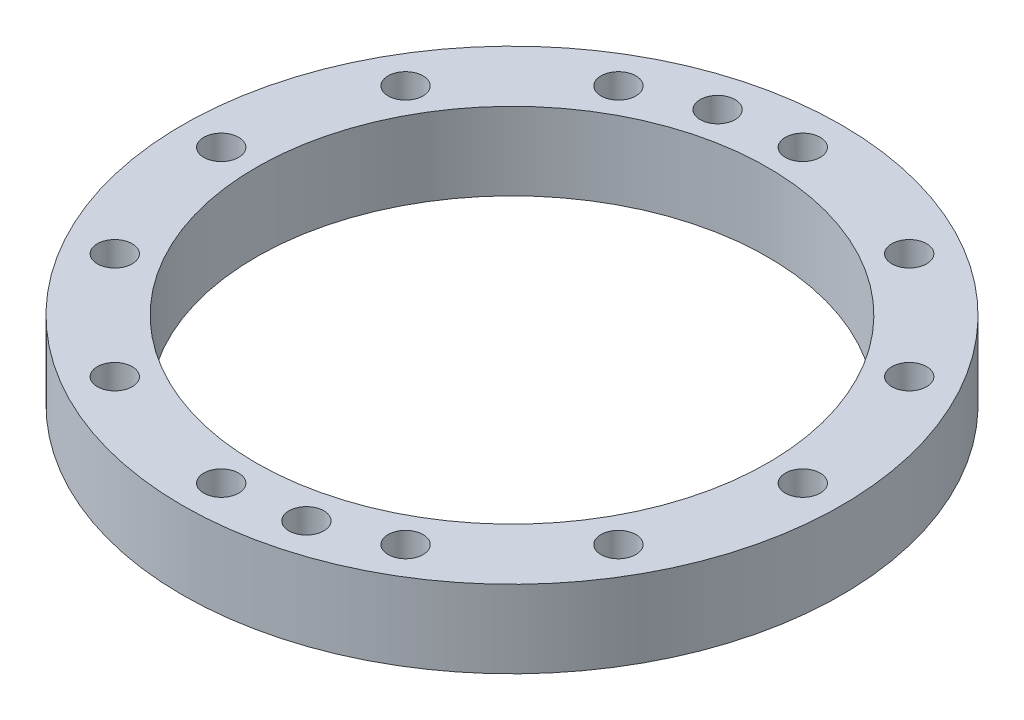
ISO-10303-21;
HEADER;
FILE_DESCRIPTION(('STEP AP214'),'2;1');
FILE_NAME('part.step','',(''),(''),'','','');
FILE_SCHEMA(('AUTOMOTIVE_DESIGN { 1 0 10303 214 1 1 1 1 }'));
ENDSEC;
DATA;
#1=APPLICATION_CONTEXT('core data for automotive mechanical design processes');
#2=APPLICATION_PROTOCOL_DEFINITION('international standard','automotive_design',2000,#1);
#3=PRODUCT_CONTEXT('',#1,'mechanical');
#4=PRODUCT('Part','Part','',(#3));
#5=PRODUCT_RELATED_PRODUCT_CATEGORY('part','',(#4));
#6=PRODUCT_DEFINITION_FORMATION('','',#4);
#7=PRODUCT_DEFINITION_CONTEXT('part definition',#1,'design');
#8=PRODUCT_DEFINITION('design','',#6,#7);
#9=PRODUCT_DEFINITION_SHAPE('','',#8);
#10=(LENGTH_UNIT() NAMED_UNIT(*) SI_UNIT(.MILLI.,.METRE.));
#11=(NAMED_UNIT(*) PLANE_ANGLE_UNIT() SI_UNIT($,.RADIAN.));
#12=(NAMED_UNIT(*) SI_UNIT($,.STERADIAN.) SOLID_ANGLE_UNIT());
#13=UNCERTAINTY_MEASURE_WITH_UNIT(LENGTH_MEASURE(1.E-05),#10,'distance_accuracy_value','');
#14=(GEOMETRIC_REPRESENTATION_CONTEXT(3) GLOBAL_UNCERTAINTY_ASSIGNED_CONTEXT((#13)) GLOBAL_UNIT_ASSIGNED_CONTEXT((#10,
#11,#12)) REPRESENTATION_CONTEXT('',''));
#15=CARTESIAN_POINT('',(0.,0.,0.));
#16=DIRECTION('',(0.,0.,1.));
#17=DIRECTION('',(1.,0.,0.));
#18=AXIS2_PLACEMENT_3D('',#15,#16,#17);
#19=CARTESIAN_POINT('',(0.,10.,0.));
#20=DIRECTION('',(0.,1.,0.));
#21=DIRECTION('',(0.,0.,1.));
#22=AXIS2_PLACEMENT_3D('',#19,#20,#21);
#23=PLANE('',#22);
#24=CARTESIAN_POINT('',(9.70571419134456,10.,36.2222184858401));
#25=DIRECTION('',(0.,1.,0.));
#26=DIRECTION('',(0.,0.,-1.));
#27=AXIS2_PLACEMENT_3D('',#24,#25,#26);
#28=CIRCLE('',#27,2.25);
#29=CARTESIAN_POINT('',(9.70571419134456,10.,33.9722184858401));
#30=VERTEX_POINT('',#29);
#31=EDGE_CURVE('E128',#30,#30,#28,.T.);
#32=ORIENTED_EDGE('',*,*,#31,.F.);
#33=EDGE_LOOP('',(#32));
#34=FACE_BOUND('',#33,.T.);
#35=CARTESIAN_POINT('',(-9.70571419134456,10.,-36.2222184858401));
#36=DIRECTION('',(0.,1.,0.));
#37=DIRECTION('',(0.,0.,1.));
#38=AXIS2_PLACEMENT_3D('',#35,#36,#37);
#39=CIRCLE('',#38,2.25);
#40=CARTESIAN_POINT('',(-9.70571419134456,10.,-33.9722184858401));
#41=VERTEX_POINT('',#40);
#42=EDGE_CURVE('E122',#41,#41,#39,.T.);
#43=ORIENTED_EDGE('',*,*,#42,.F.);
#44=EDGE_LOOP('',(#43));
#45=FACE_BOUND('',#44,.T.);
#46=CARTESIAN_POINT('',(-32.4759526419165,10.,-18.7499999999999));
#47=DIRECTION('',(0.,1.,0.));
#48=DIRECTION('',(0.86602540378444,0.,0.499999999999998));
#49=AXIS2_PLACEMENT_3D('',#46,#47,#48);
#50=CIRCLE('',#49,2.25);
#51=CARTESIAN_POINT('',(-30.5273954834015,10.,-17.6249999999999));
#52=VERTEX_POINT('',#51);
#53=EDGE_CURVE('E105',#52,#52,#50,.T.);
#54=ORIENTED_EDGE('',*,*,#53,.F.);
#55=EDGE_LOOP('',(#54));
#56=FACE_BOUND('',#55,.T.);
#57=CARTESIAN_POINT('',(-37.5,10.,1.30930550206618E-13));
#58=DIRECTION('',(0.,1.,0.));
#59=DIRECTION('',(1.,0.,0.));
#60=AXIS2_PLACEMENT_3D('',#57,#58,#59);
#61=CIRCLE('',#60,2.25);
#62=CARTESIAN_POINT('',(-35.25,10.,1.2307471719422E-13));
#63=VERTEX_POINT('',#62);
#64=EDGE_CURVE('E99',#63,#63,#61,.T.);
#65=ORIENTED_EDGE('',*,*,#64,.F.);
#66=EDGE_LOOP('',(#65));
#67=FACE_BOUND('',#66,.T.);
#68=CARTESIAN_POINT('',(-32.4759526419164,10.,18.7500000000002));
#69=DIRECTION('',(0.,1.,0.));
#70=DIRECTION('',(0.866025403784436,0.,-0.500000000000004));
#71=AXIS2_PLACEMENT_3D('',#68,#69,#70);
#72=CIRCLE('',#71,2.25);
#73=CARTESIAN_POINT('',(-30.5273954834014,10.,17.6250000000001));
#74=VERTEX_POINT('',#73);
#75=EDGE_CURVE('E93',#74,#74,#72,.T.);
#76=ORIENTED_EDGE('',*,*,#75,.F.);
#77=EDGE_LOOP('',(#76));
#78=FACE_BOUND('',#77,.T.);
#79=CARTESIAN_POINT('',(-18.7499999999998,10.,32.4759526419166));
#80=DIRECTION('',(0.,1.,0.));
#81=DIRECTION('',(0.499999999999995,0.,-0.866025403784442));
#82=AXIS2_PLACEMENT_3D('',#79,#80,#81);
#83=CIRCLE('',#82,2.25);
#84=CARTESIAN_POINT('',(-17.6249999999998,10.,30.5273954834016));
#85=VERTEX_POINT('',#84);
#86=EDGE_CURVE('E87',#85,#85,#83,.T.);
#87=ORIENTED_EDGE('',*,*,#86,.F.);
#88=EDGE_LOOP('',(#87));
#89=FACE_BOUND('',#88,.T.);
#90=CARTESIAN_POINT('',(0.,10.,37.5));
#91=DIRECTION('',(0.,1.,0.));
#92=DIRECTION('',(0.,0.,-1.));
#93=AXIS2_PLACEMENT_3D('',#90,#91,#92);
#94=CIRCLE('',#93,2.25);
#95=CARTESIAN_POINT('',(0.,10.,35.25));
#96=VERTEX_POINT('',#95);
#97=EDGE_CURVE('E81',#96,#96,#94,.T.);
#98=ORIENTED_EDGE('',*,*,#97,.F.);
#99=EDGE_LOOP('',(#98));
#100=FACE_BOUND('',#99,.T.);
#101=CARTESIAN_POINT('',(18.7500000000003,10.,32.4759526419163));
#102=DIRECTION('',(0.,1.,0.));
#103=DIRECTION('',(-0.500000000000007,0.,-0.866025403784435));
#104=AXIS2_PLACEMENT_3D('',#101,#102,#103);
#105=CIRCLE('',#104,2.25);
#106=CARTESIAN_POINT('',(17.6250000000003,10.,30.5273954834013));
#107=VERTEX_POINT('',#106);
#108=EDGE_CURVE('E75',#107,#107,#105,.T.);
#109=ORIENTED_EDGE('',*,*,#108,.F.);
#110=EDGE_LOOP('',(#109));
#111=FACE_BOUND('',#110,.T.);
#112=CARTESIAN_POINT('',(32.4759526419166,10.,18.7499999999997));
#113=DIRECTION('',(0.,1.,0.));
#114=DIRECTION('',(-0.866025403784443,0.,-0.499999999999992));
#115=AXIS2_PLACEMENT_3D('',#112,#113,#114);
#116=CIRCLE('',#115,2.25);
#117=CARTESIAN_POINT('',(30.5273954834016,10.,17.6249999999997));
#118=VERTEX_POINT('',#117);
#119=EDGE_CURVE('E69',#118,#118,#116,.T.);
#120=ORIENTED_EDGE('',*,*,#119,.F.);
#121=EDGE_LOOP('',(#120));
#122=FACE_BOUND('',#121,.T.);
#123=CARTESIAN_POINT('',(37.5,10.,-3.92791650619852E-13));
#124=DIRECTION('',(0.,1.,0.));
#125=DIRECTION('',(-1.,0.,0.));
#126=AXIS2_PLACEMENT_3D('',#123,#124,#125);
#127=CIRCLE('',#126,2.25);
#128=CARTESIAN_POINT('',(35.25,10.,-3.69224151582661E-13));
#129=VERTEX_POINT('',#128);
#130=EDGE_CURVE('E62',#129,#129,#127,.T.);
#131=ORIENTED_EDGE('',*,*,#130,.F.);
#132=EDGE_LOOP('',(#131));
#133=FACE_BOUND('',#132,.T.);
#134=CARTESIAN_POINT('',(32.4759526419162,10.,-18.7500000000004));
#135=DIRECTION('',(0.,1.,0.));
#136=DIRECTION('',(-0.866025403784433,0.,0.50000000000001));
#137=AXIS2_PLACEMENT_3D('',#134,#135,#136);
#138=CIRCLE('',#137,2.25);
#139=CARTESIAN_POINT('',(30.5273954834013,10.,-17.6250000000004));
#140=VERTEX_POINT('',#139);
#141=EDGE_CURVE('E117',#140,#140,#138,.T.);
#142=ORIENTED_EDGE('',*,*,#141,.F.);
#143=EDGE_LOOP('',(#142));
#144=FACE_BOUND('',#143,.T.);
#145=CARTESIAN_POINT('',(18.7499999999996,10.,-32.4759526419167));
#146=DIRECTION('',(0.,1.,0.));
#147=DIRECTION('',(-0.499999999999989,0.,0.866025403784445));
#148=AXIS2_PLACEMENT_3D('',#145,#146,#147);
#149=CIRCLE('',#148,2.25);
#150=CARTESIAN_POINT('',(17.6249999999996,10.,-30.5273954834017));
#151=VERTEX_POINT('',#150);
#152=EDGE_CURVE('E110',#151,#151,#149,.T.);
#153=ORIENTED_EDGE('',*,*,#152,.F.);
#154=EDGE_LOOP('',(#153));
#155=FACE_BOUND('',#154,.T.);
#156=CARTESIAN_POINT('',(-18.75,10.,-32.4759526419164));
#157=DIRECTION('',(0.,1.,0.));
#158=DIRECTION('',(0.500000000000001,0.,0.866025403784438));
#159=AXIS2_PLACEMENT_3D('',#156,#157,#158);
#160=CIRCLE('',#159,2.25);
#161=CARTESIAN_POINT('',(-17.625,10.,-30.5273954834014));
#162=VERTEX_POINT('',#161);
#163=EDGE_CURVE('E56',#162,#162,#160,.T.);
#164=ORIENTED_EDGE('',*,*,#163,.F.);
#165=EDGE_LOOP('',(#164));
#166=FACE_BOUND('',#165,.T.);
#167=CARTESIAN_POINT('',(0.,10.,-37.5));
#168=DIRECTION('',(0.,1.,0.));
#169=DIRECTION('',(0.,0.,1.));
#170=AXIS2_PLACEMENT_3D('',#167,#168,#169);
#171=CIRCLE('',#170,2.25);
#172=CARTESIAN_POINT('',(0.,10.,-35.25));
#173=VERTEX_POINT('',#172);
#174=EDGE_CURVE('E50',#173,#173,#171,.T.);
#175=ORIENTED_EDGE('',*,*,#174,.F.);
#176=EDGE_LOOP('',(#175));
#177=FACE_BOUND('',#176,.T.);
#178=CARTESIAN_POINT('',(0.,10.,0.));
#179=DIRECTION('',(0.,1.,0.));
#180=DIRECTION('',(0.,0.,1.));
#181=AXIS2_PLACEMENT_3D('',#178,#179,#180);
#182=CIRCLE('',#181,42.5);
#183=CARTESIAN_POINT('',(0.,10.,42.5));
#184=VERTEX_POINT('',#183);
#185=EDGE_CURVE('E10',#184,#184,#182,.T.);
#186=ORIENTED_EDGE('',*,*,#185,.T.);
#187=EDGE_LOOP('',(#186));
#188=FACE_BOUND('',#187,.T.);
#189=CARTESIAN_POINT('',(0.,10.,0.));
#190=DIRECTION('',(0.,1.,0.));
#191=DIRECTION('',(0.,0.,1.));
#192=AXIS2_PLACEMENT_3D('',#189,#190,#191);
#193=CIRCLE('',#192,33.);
#194=CARTESIAN_POINT('',(0.,10.,33.));
#195=VERTEX_POINT('',#194);
#196=EDGE_CURVE('E42',#195,#195,#193,.T.);
#197=ORIENTED_EDGE('',*,*,#196,.F.);
#198=EDGE_LOOP('',(#197));
#199=FACE_BOUND('',#198,.T.);
#200=ADVANCED_FACE('F31',(#34,#45,#56,#67,#78,#89,#100,#111,#122,#133,#144,#155,#166,#177,#188,
#199),#23,.T.);
#201=CARTESIAN_POINT('',(0.,0.,0.));
#202=DIRECTION('',(0.,1.,0.));
#203=DIRECTION('',(0.,0.,1.));
#204=AXIS2_PLACEMENT_3D('',#201,#202,#203);
#205=PLANE('',#204);
#206=CARTESIAN_POINT('',(9.70571419134456,0.,36.2222184858401));
#207=DIRECTION('',(0.,1.,0.));
#208=DIRECTION('',(0.,0.,-1.));
#209=AXIS2_PLACEMENT_3D('',#206,#207,#208);
#210=CIRCLE('',#209,2.25);
#211=CARTESIAN_POINT('',(9.70571419134456,0.,33.9722184858401));
#212=VERTEX_POINT('',#211);
#213=EDGE_CURVE('E125',#212,#212,#210,.T.);
#214=ORIENTED_EDGE('',*,*,#213,.T.);
#215=EDGE_LOOP('',(#214));
#216=FACE_BOUND('',#215,.T.);
#217=CARTESIAN_POINT('',(-9.70571419134456,0.,-36.2222184858401));
#218=DIRECTION('',(0.,1.,0.));
#219=DIRECTION('',(0.,0.,1.));
#220=AXIS2_PLACEMENT_3D('',#217,#218,#219);
#221=CIRCLE('',#220,2.25);
#222=CARTESIAN_POINT('',(-9.70571419134456,0.,-33.9722184858401));
#223=VERTEX_POINT('',#222);
#224=EDGE_CURVE('E114',#223,#223,#221,.T.);
#225=ORIENTED_EDGE('',*,*,#224,.T.);
#226=EDGE_LOOP('',(#225));
#227=FACE_BOUND('',#226,.T.);
#228=CARTESIAN_POINT('',(-32.4759526419165,0.,-18.7499999999999));
#229=DIRECTION('',(0.,1.,0.));
#230=DIRECTION('',(0.86602540378444,0.,0.499999999999998));
#231=AXIS2_PLACEMENT_3D('',#228,#229,#230);
#232=CIRCLE('',#231,2.25);
#233=CARTESIAN_POINT('',(-30.5273954834015,0.,-17.6249999999999));
#234=VERTEX_POINT('',#233);
#235=EDGE_CURVE('E59',#234,#234,#232,.T.);
#236=ORIENTED_EDGE('',*,*,#235,.T.);
#237=EDGE_LOOP('',(#236));
#238=FACE_BOUND('',#237,.T.);
#239=CARTESIAN_POINT('',(-37.5,0.,1.30930550206618E-13));
#240=DIRECTION('',(0.,1.,0.));
#241=DIRECTION('',(1.,0.,0.));
#242=AXIS2_PLACEMENT_3D('',#239,#240,#241);
#243=CIRCLE('',#242,2.25);
#244=CARTESIAN_POINT('',(-35.25,0.,1.2307471719422E-13));
#245=VERTEX_POINT('',#244);
#246=EDGE_CURVE('E102',#245,#245,#243,.T.);
#247=ORIENTED_EDGE('',*,*,#246,.T.);
#248=EDGE_LOOP('',(#247));
#249=FACE_BOUND('',#248,.T.);
#250=CARTESIAN_POINT('',(-32.4759526419164,0.,18.7500000000002));
#251=DIRECTION('',(0.,1.,0.));
#252=DIRECTION('',(0.866025403784436,0.,-0.500000000000004));
#253=AXIS2_PLACEMENT_3D('',#250,#251,#252);
#254=CIRCLE('',#253,2.25);
#255=CARTESIAN_POINT('',(-30.5273954834014,0.,17.6250000000001));
#256=VERTEX_POINT('',#255);
#257=EDGE_CURVE('E96',#256,#256,#254,.T.);
#258=ORIENTED_EDGE('',*,*,#257,.T.);
#259=EDGE_LOOP('',(#258));
#260=FACE_BOUND('',#259,.T.);
#261=CARTESIAN_POINT('',(-18.7499999999998,0.,32.4759526419166));
#262=DIRECTION('',(0.,1.,0.));
#263=DIRECTION('',(0.499999999999995,0.,-0.866025403784442));
#264=AXIS2_PLACEMENT_3D('',#261,#262,#263);
#265=CIRCLE('',#264,2.25);
#266=CARTESIAN_POINT('',(-17.6249999999998,0.,30.5273954834016));
#267=VERTEX_POINT('',#266);
#268=EDGE_CURVE('E90',#267,#267,#265,.T.);
#269=ORIENTED_EDGE('',*,*,#268,.T.);
#270=EDGE_LOOP('',(#269));
#271=FACE_BOUND('',#270,.T.);
#272=CARTESIAN_POINT('',(0.,0.,37.5));
#273=DIRECTION('',(0.,1.,0.));
#274=DIRECTION('',(0.,0.,-1.));
#275=AXIS2_PLACEMENT_3D('',#272,#273,#274);
#276=CIRCLE('',#275,2.25);
#277=CARTESIAN_POINT('',(0.,0.,35.25));
#278=VERTEX_POINT('',#277);
#279=EDGE_CURVE('E84',#278,#278,#276,.T.);
#280=ORIENTED_EDGE('',*,*,#279,.T.);
#281=EDGE_LOOP('',(#280));
#282=FACE_BOUND('',#281,.T.);
#283=CARTESIAN_POINT('',(18.7500000000003,0.,32.4759526419163));
#284=DIRECTION('',(0.,1.,0.));
#285=DIRECTION('',(-0.500000000000007,0.,-0.866025403784435));
#286=AXIS2_PLACEMENT_3D('',#283,#284,#285);
#287=CIRCLE('',#286,2.25);
#288=CARTESIAN_POINT('',(17.6250000000003,0.,30.5273954834013));
#289=VERTEX_POINT('',#288);
#290=EDGE_CURVE('E78',#289,#289,#287,.T.);
#291=ORIENTED_EDGE('',*,*,#290,.T.);
#292=EDGE_LOOP('',(#291));
#293=FACE_BOUND('',#292,.T.);
#294=CARTESIAN_POINT('',(32.4759526419166,0.,18.7499999999997));
#295=DIRECTION('',(0.,1.,0.));
#296=DIRECTION('',(-0.866025403784443,0.,-0.499999999999992));
#297=AXIS2_PLACEMENT_3D('',#294,#295,#296);
#298=CIRCLE('',#297,2.25);
#299=CARTESIAN_POINT('',(30.5273954834016,0.,17.6249999999997));
#300=VERTEX_POINT('',#299);
#301=EDGE_CURVE('E72',#300,#300,#298,.T.);
#302=ORIENTED_EDGE('',*,*,#301,.T.);
#303=EDGE_LOOP('',(#302));
#304=FACE_BOUND('',#303,.T.);
#305=CARTESIAN_POINT('',(37.5,0.,-3.92791650619852E-13));
#306=DIRECTION('',(0.,1.,0.));
#307=DIRECTION('',(-1.,0.,0.));
#308=AXIS2_PLACEMENT_3D('',#305,#306,#307);
#309=CIRCLE('',#308,2.25);
#310=CARTESIAN_POINT('',(35.25,0.,-3.69224151582661E-13));
#311=VERTEX_POINT('',#310);
#312=EDGE_CURVE('E65',#311,#311,#309,.T.);
#313=ORIENTED_EDGE('',*,*,#312,.T.);
#314=EDGE_LOOP('',(#313));
#315=FACE_BOUND('',#314,.T.);
#316=CARTESIAN_POINT('',(32.4759526419162,0.,-18.7500000000004));
#317=DIRECTION('',(0.,1.,0.));
#318=DIRECTION('',(-0.866025403784433,0.,0.50000000000001));
#319=AXIS2_PLACEMENT_3D('',#316,#317,#318);
#320=CIRCLE('',#319,2.25);
#321=CARTESIAN_POINT('',(30.5273954834013,0.,-17.6250000000004));
#322=VERTEX_POINT('',#321);
#323=EDGE_CURVE('E66',#322,#322,#320,.T.);
#324=ORIENTED_EDGE('',*,*,#323,.T.);
#325=EDGE_LOOP('',(#324));
#326=FACE_BOUND('',#325,.T.);
#327=CARTESIAN_POINT('',(18.7499999999996,0.,-32.4759526419167));
#328=DIRECTION('',(0.,1.,0.));
#329=DIRECTION('',(-0.499999999999989,0.,0.866025403784445));
#330=AXIS2_PLACEMENT_3D('',#327,#328,#329);
#331=CIRCLE('',#330,2.25);
#332=CARTESIAN_POINT('',(17.6249999999996,0.,-30.5273954834017));
#333=VERTEX_POINT('',#332);
#334=EDGE_CURVE('E113',#333,#333,#331,.T.);
#335=ORIENTED_EDGE('',*,*,#334,.T.);
#336=EDGE_LOOP('',(#335));
#337=FACE_BOUND('',#336,.T.);
#338=CARTESIAN_POINT('',(-18.75,0.,-32.4759526419164));
#339=DIRECTION('',(0.,1.,0.));
#340=DIRECTION('',(0.500000000000001,0.,0.866025403784438));
#341=AXIS2_PLACEMENT_3D('',#338,#339,#340);
#342=CIRCLE('',#341,2.25);
#343=CARTESIAN_POINT('',(-17.625,0.,-30.5273954834014));
#344=VERTEX_POINT('',#343);
#345=EDGE_CURVE('E53',#344,#344,#342,.T.);
#346=ORIENTED_EDGE('',*,*,#345,.T.);
#347=EDGE_LOOP('',(#346));
#348=FACE_BOUND('',#347,.T.);
#349=CARTESIAN_POINT('',(0.,0.,-37.5));
#350=DIRECTION('',(0.,1.,0.));
#351=DIRECTION('',(0.,0.,1.));
#352=AXIS2_PLACEMENT_3D('',#349,#350,#351);
#353=CIRCLE('',#352,2.25);
#354=CARTESIAN_POINT('',(0.,0.,-35.25));
#355=VERTEX_POINT('',#354);
#356=EDGE_CURVE('E47',#355,#355,#353,.T.);
#357=ORIENTED_EDGE('',*,*,#356,.T.);
#358=EDGE_LOOP('',(#357));
#359=FACE_BOUND('',#358,.T.);
#360=CARTESIAN_POINT('',(0.,0.,0.));
#361=DIRECTION('',(0.,1.,0.));
#362=DIRECTION('',(0.,0.,1.));
#363=AXIS2_PLACEMENT_3D('',#360,#361,#362);
#364=CIRCLE('',#363,42.5);
#365=CARTESIAN_POINT('',(0.,0.,42.5));
#366=VERTEX_POINT('',#365);
#367=EDGE_CURVE('E35',#366,#366,#364,.T.);
#368=ORIENTED_EDGE('',*,*,#367,.F.);
#369=EDGE_LOOP('',(#368));
#370=FACE_BOUND('',#369,.T.);
#371=CARTESIAN_POINT('',(0.,0.,0.));
#372=DIRECTION('',(0.,1.,0.));
#373=DIRECTION('',(0.,0.,1.));
#374=AXIS2_PLACEMENT_3D('',#371,#372,#373);
#375=CIRCLE('',#374,33.);
#376=CARTESIAN_POINT('',(0.,0.,33.));
#377=VERTEX_POINT('',#376);
#378=EDGE_CURVE('E44',#377,#377,#375,.T.);
#379=ORIENTED_EDGE('',*,*,#378,.T.);
#380=EDGE_LOOP('',(#379));
#381=FACE_BOUND('',#380,.T.);
#382=ADVANCED_FACE('F134',(#216,#227,#238,#249,#260,#271,#282,#293,#304,#315,#326,#337,#348,
#359,#370,#381),#205,.F.);
#383=CARTESIAN_POINT('',(0.,10.,0.));
#384=DIRECTION('',(0.,-1.,0.));
#385=DIRECTION('',(0.,0.,-1.));
#386=AXIS2_PLACEMENT_3D('',#383,#384,#385);
#387=CYLINDRICAL_SURFACE('',#386,42.5);
#388=ORIENTED_EDGE('',*,*,#185,.F.);
#389=EDGE_LOOP('',(#388));
#390=FACE_BOUND('',#389,.T.);
#391=ORIENTED_EDGE('',*,*,#367,.T.);
#392=EDGE_LOOP('',(#391));
#393=FACE_BOUND('',#392,.T.);
#394=ADVANCED_FACE('F33',(#390,#393),#387,.T.);
#395=CARTESIAN_POINT('',(0.,10.,0.));
#396=DIRECTION('',(0.,-1.,0.));
#397=DIRECTION('',(0.,0.,-1.));
#398=AXIS2_PLACEMENT_3D('',#395,#396,#397);
#399=CYLINDRICAL_SURFACE('',#398,33.);
#400=ORIENTED_EDGE('',*,*,#196,.T.);
#401=EDGE_LOOP('',(#400));
#402=FACE_BOUND('',#401,.T.);
#403=ORIENTED_EDGE('',*,*,#378,.F.);
#404=EDGE_LOOP('',(#403));
#405=FACE_BOUND('',#404,.T.);
#406=ADVANCED_FACE('F175',(#402,#405),#399,.F.);
#407=CARTESIAN_POINT('',(0.,0.,-37.5));
#408=DIRECTION('',(0.,1.,0.));
#409=DIRECTION('',(0.,0.,1.));
#410=AXIS2_PLACEMENT_3D('',#407,#408,#409);
#411=CYLINDRICAL_SURFACE('',#410,2.25);
#412=ORIENTED_EDGE('',*,*,#356,.F.);
#413=EDGE_LOOP('',(#412));
#414=FACE_BOUND('',#413,.T.);
#415=ORIENTED_EDGE('',*,*,#174,.T.);
#416=EDGE_LOOP('',(#415));
#417=FACE_BOUND('',#416,.T.);
#418=ADVANCED_FACE('F178',(#414,#417),#411,.F.);
#419=CARTESIAN_POINT('',(-18.75,0.,-32.4759526419164));
#420=DIRECTION('',(0.,1.,0.));
#421=DIRECTION('',(0.,0.,1.));
#422=AXIS2_PLACEMENT_3D('',#419,#420,#421);
#423=CYLINDRICAL_SURFACE('',#422,2.25);
#424=ORIENTED_EDGE('',*,*,#345,.F.);
#425=EDGE_LOOP('',(#424));
#426=FACE_BOUND('',#425,.T.);
#427=ORIENTED_EDGE('',*,*,#163,.T.);
#428=EDGE_LOOP('',(#427));
#429=FACE_BOUND('',#428,.T.);
#430=ADVANCED_FACE('F190',(#426,#429),#423,.F.);
#431=CARTESIAN_POINT('',(18.7499999999996,0.,-32.4759526419167));
#432=DIRECTION('',(0.,1.,0.));
#433=DIRECTION('',(0.,0.,1.));
#434=AXIS2_PLACEMENT_3D('',#431,#432,#433);
#435=CYLINDRICAL_SURFACE('',#434,2.25);
#436=ORIENTED_EDGE('',*,*,#334,.F.);
#437=EDGE_LOOP('',(#436));
#438=FACE_BOUND('',#437,.T.);
#439=ORIENTED_EDGE('',*,*,#152,.T.);
#440=EDGE_LOOP('',(#439));
#441=FACE_BOUND('',#440,.T.);
#442=ADVANCED_FACE('F194',(#438,#441),#435,.F.);
#443=CARTESIAN_POINT('',(32.4759526419162,0.,-18.7500000000004));
#444=DIRECTION('',(0.,1.,0.));
#445=DIRECTION('',(0.,0.,1.));
#446=AXIS2_PLACEMENT_3D('',#443,#444,#445);
#447=CYLINDRICAL_SURFACE('',#446,2.25);
#448=ORIENTED_EDGE('',*,*,#323,.F.);
#449=EDGE_LOOP('',(#448));
#450=FACE_BOUND('',#449,.T.);
#451=ORIENTED_EDGE('',*,*,#141,.T.);
#452=EDGE_LOOP('',(#451));
#453=FACE_BOUND('',#452,.T.);
#454=ADVANCED_FACE('F200',(#450,#453),#447,.F.);
#455=CARTESIAN_POINT('',(37.5,0.,-3.92791650619852E-13));
#456=DIRECTION('',(0.,1.,0.));
#457=DIRECTION('',(0.,0.,1.));
#458=AXIS2_PLACEMENT_3D('',#455,#456,#457);
#459=CYLINDRICAL_SURFACE('',#458,2.25);
#460=ORIENTED_EDGE('',*,*,#312,.F.);
#461=EDGE_LOOP('',(#460));
#462=FACE_BOUND('',#461,.T.);
#463=ORIENTED_EDGE('',*,*,#130,.T.);
#464=EDGE_LOOP('',(#463));
#465=FACE_BOUND('',#464,.T.);
#466=ADVANCED_FACE('F196',(#462,#465),#459,.F.);
#467=CARTESIAN_POINT('',(32.4759526419166,0.,18.7499999999997));
#468=DIRECTION('',(0.,1.,0.));
#469=DIRECTION('',(0.,0.,1.));
#470=AXIS2_PLACEMENT_3D('',#467,#468,#469);
#471=CYLINDRICAL_SURFACE('',#470,2.25);
#472=ORIENTED_EDGE('',*,*,#301,.F.);
#473=EDGE_LOOP('',(#472));
#474=FACE_BOUND('',#473,.T.);
#475=ORIENTED_EDGE('',*,*,#119,.T.);
#476=EDGE_LOOP('',(#475));
#477=FACE_BOUND('',#476,.T.);
#478=ADVANCED_FACE('F199',(#474,#477),#471,.F.);
#479=CARTESIAN_POINT('',(18.7500000000003,0.,32.4759526419163));
#480=DIRECTION('',(0.,1.,0.));
#481=DIRECTION('',(0.,0.,1.));
#482=AXIS2_PLACEMENT_3D('',#479,#480,#481);
#483=CYLINDRICAL_SURFACE('',#482,2.25);
#484=ORIENTED_EDGE('',*,*,#290,.F.);
#485=EDGE_LOOP('',(#484));
#486=FACE_BOUND('',#485,.T.);
#487=ORIENTED_EDGE('',*,*,#108,.T.);
#488=EDGE_LOOP('',(#487));
#489=FACE_BOUND('',#488,.T.);
#490=ADVANCED_FACE('F204',(#486,#489),#483,.F.);
#491=CARTESIAN_POINT('',(0.,0.,37.5));
#492=DIRECTION('',(0.,1.,0.));
#493=DIRECTION('',(0.,0.,1.));
#494=AXIS2_PLACEMENT_3D('',#491,#492,#493);
#495=CYLINDRICAL_SURFACE('',#494,2.25);
#496=ORIENTED_EDGE('',*,*,#279,.F.);
#497=EDGE_LOOP('',(#496));
#498=FACE_BOUND('',#497,.T.);
#499=ORIENTED_EDGE('',*,*,#97,.T.);
#500=EDGE_LOOP('',(#499));
#501=FACE_BOUND('',#500,.T.);
#502=ADVANCED_FACE('F208',(#498,#501),#495,.F.);
#503=CARTESIAN_POINT('',(-18.7499999999998,0.,32.4759526419166));
#504=DIRECTION('',(0.,1.,0.));
#505=DIRECTION('',(0.,0.,1.));
#506=AXIS2_PLACEMENT_3D('',#503,#504,#505);
#507=CYLINDRICAL_SURFACE('',#506,2.25);
#508=ORIENTED_EDGE('',*,*,#268,.F.);
#509=EDGE_LOOP('',(#508));
#510=FACE_BOUND('',#509,.T.);
#511=ORIENTED_EDGE('',*,*,#86,.T.);
#512=EDGE_LOOP('',(#511));
#513=FACE_BOUND('',#512,.T.);
#514=ADVANCED_FACE('F212',(#510,#513),#507,.F.);
#515=CARTESIAN_POINT('',(-32.4759526419164,0.,18.7500000000002));
#516=DIRECTION('',(0.,1.,0.));
#517=DIRECTION('',(0.,0.,1.));
#518=AXIS2_PLACEMENT_3D('',#515,#516,#517);
#519=CYLINDRICAL_SURFACE('',#518,2.25);
#520=ORIENTED_EDGE('',*,*,#257,.F.);
#521=EDGE_LOOP('',(#520));
#522=FACE_BOUND('',#521,.T.);
#523=ORIENTED_EDGE('',*,*,#75,.T.);
#524=EDGE_LOOP('',(#523));
#525=FACE_BOUND('',#524,.T.);
#526=ADVANCED_FACE('F216',(#522,#525),#519,.F.);
#527=CARTESIAN_POINT('',(-37.5,0.,1.30930550206618E-13));
#528=DIRECTION('',(0.,1.,0.));
#529=DIRECTION('',(0.,0.,1.));
#530=AXIS2_PLACEMENT_3D('',#527,#528,#529);
#531=CYLINDRICAL_SURFACE('',#530,2.25);
#532=ORIENTED_EDGE('',*,*,#246,.F.);
#533=EDGE_LOOP('',(#532));
#534=FACE_BOUND('',#533,.T.);
#535=ORIENTED_EDGE('',*,*,#64,.T.);
#536=EDGE_LOOP('',(#535));
#537=FACE_BOUND('',#536,.T.);
#538=ADVANCED_FACE('F220',(#534,#537),#531,.F.);
#539=CARTESIAN_POINT('',(-32.4759526419165,0.,-18.7499999999999));
#540=DIRECTION('',(0.,1.,0.));
#541=DIRECTION('',(0.,0.,1.));
#542=AXIS2_PLACEMENT_3D('',#539,#540,#541);
#543=CYLINDRICAL_SURFACE('',#542,2.25);
#544=ORIENTED_EDGE('',*,*,#235,.F.);
#545=EDGE_LOOP('',(#544));
#546=FACE_BOUND('',#545,.T.);
#547=ORIENTED_EDGE('',*,*,#53,.T.);
#548=EDGE_LOOP('',(#547));
#549=FACE_BOUND('',#548,.T.);
#550=ADVANCED_FACE('F224',(#546,#549),#543,.F.);
#551=CARTESIAN_POINT('',(-9.70571419134456,0.,-36.2222184858401));
#552=DIRECTION('',(0.,1.,0.));
#553=DIRECTION('',(0.,0.,1.));
#554=AXIS2_PLACEMENT_3D('',#551,#552,#553);
#555=CYLINDRICAL_SURFACE('',#554,2.25);
#556=ORIENTED_EDGE('',*,*,#224,.F.);
#557=EDGE_LOOP('',(#556));
#558=FACE_BOUND('',#557,.T.);
#559=ORIENTED_EDGE('',*,*,#42,.T.);
#560=EDGE_LOOP('',(#559));
#561=FACE_BOUND('',#560,.T.);
#562=ADVANCED_FACE('F140',(#558,#561),#555,.F.);
#563=CARTESIAN_POINT('',(9.70571419134456,0.,36.2222184858401));
#564=DIRECTION('',(0.,1.,0.));
#565=DIRECTION('',(0.,0.,1.));
#566=AXIS2_PLACEMENT_3D('',#563,#564,#565);
#567=CYLINDRICAL_SURFACE('',#566,2.25);
#568=ORIENTED_EDGE('',*,*,#213,.F.);
#569=EDGE_LOOP('',(#568));
#570=FACE_BOUND('',#569,.T.);
#571=ORIENTED_EDGE('',*,*,#31,.T.);
#572=EDGE_LOOP('',(#571));
#573=FACE_BOUND('',#572,.T.);
#574=ADVANCED_FACE('F137',(#570,#573),#567,.F.);
#575=CLOSED_SHELL('',(#200,#382,#394,#406,#418,#430,#442,#454,#466,#478,#490,#502,#514,#526,
#538,#550,#562,#574));
#576=MANIFOLD_SOLID_BREP('B2',#575);
#577=ADVANCED_BREP_SHAPE_REPRESENTATION('',(#18,#576),#14);
#578=SHAPE_DEFINITION_REPRESENTATION(#9,#577);
ENDSEC;
END-ISO-10303-21;
